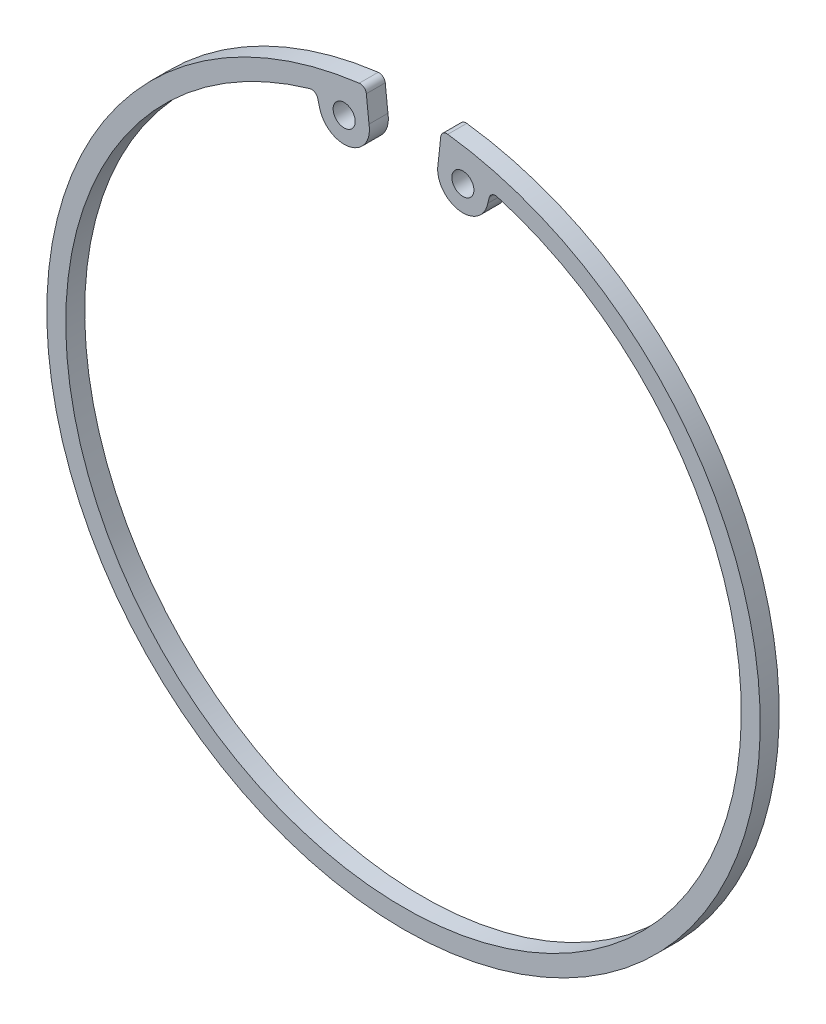
ISO-10303-21;
HEADER;
FILE_DESCRIPTION(('STEP AP214'),'2;1');
FILE_NAME('part.step','',(''),(''),'','','');
FILE_SCHEMA(('AUTOMOTIVE_DESIGN { 1 0 10303 214 1 1 1 1 }'));
ENDSEC;
DATA;
#1=APPLICATION_CONTEXT('core data for automotive mechanical design processes');
#2=APPLICATION_PROTOCOL_DEFINITION('international standard','automotive_design',2000,#1);
#3=PRODUCT_CONTEXT('',#1,'mechanical');
#4=PRODUCT('Part','Part','',(#3));
#5=PRODUCT_RELATED_PRODUCT_CATEGORY('part','',(#4));
#6=PRODUCT_DEFINITION_FORMATION('','',#4);
#7=PRODUCT_DEFINITION_CONTEXT('part definition',#1,'design');
#8=PRODUCT_DEFINITION('design','',#6,#7);
#9=PRODUCT_DEFINITION_SHAPE('','',#8);
#10=(LENGTH_UNIT() NAMED_UNIT(*) SI_UNIT(.MILLI.,.METRE.));
#11=(NAMED_UNIT(*) PLANE_ANGLE_UNIT() SI_UNIT($,.RADIAN.));
#12=(NAMED_UNIT(*) SI_UNIT($,.STERADIAN.) SOLID_ANGLE_UNIT());
#13=UNCERTAINTY_MEASURE_WITH_UNIT(LENGTH_MEASURE(1.E-05),#10,'distance_accuracy_value','');
#14=(GEOMETRIC_REPRESENTATION_CONTEXT(3) GLOBAL_UNCERTAINTY_ASSIGNED_CONTEXT((#13)) GLOBAL_UNIT_ASSIGNED_CONTEXT((#10,
#11,#12)) REPRESENTATION_CONTEXT('',''));
#15=CARTESIAN_POINT('',(0.,0.,0.));
#16=DIRECTION('',(0.,0.,1.));
#17=DIRECTION('',(1.,0.,0.));
#18=AXIS2_PLACEMENT_3D('',#15,#16,#17);
#19=CARTESIAN_POINT('',(-9.40140029789351,50.4763674647716,3.));
#20=DIRECTION('',(0.,0.,1.));
#21=DIRECTION('',(1.,0.,0.));
#22=AXIS2_PLACEMENT_3D('',#19,#20,#21);
#23=PLANE('',#22);
#24=CARTESIAN_POINT('',(-9.40140029789351,50.4763674647716,3.));
#25=DIRECTION('',(0.,0.,1.));
#26=DIRECTION('',(1.,0.,0.));
#27=AXIS2_PLACEMENT_3D('',#24,#25,#26);
#28=CIRCLE('',#27,1.74999999999995);
#29=CARTESIAN_POINT('',(-7.65140029789356,50.4763674647716,3.));
#30=VERTEX_POINT('',#29);
#31=EDGE_CURVE('E161',#30,#30,#28,.T.);
#32=ORIENTED_EDGE('',*,*,#31,.F.);
#33=EDGE_LOOP('',(#32));
#34=FACE_BOUND('',#33,.T.);
#35=CARTESIAN_POINT('',(-9.40140029789351,50.4763674647716,3.));
#36=DIRECTION('',(0.,0.,1.));
#37=DIRECTION('',(1.,0.,0.));
#38=AXIS2_PLACEMENT_3D('',#35,#36,#37);
#39=CIRCLE('',#38,3.99999999999983);
#40=CARTESIAN_POINT('',(-13.3337740471144,49.7439490758446,3.));
#41=VERTEX_POINT('',#40);
#42=CARTESIAN_POINT('',(-5.46902654867294,51.2087858536985,3.));
#43=VERTEX_POINT('',#42);
#44=EDGE_CURVE('E181',#41,#43,#39,.T.);
#45=ORIENTED_EDGE('',*,*,#44,.T.);
#46=DIRECTION('',(-0.106194690265146,0.994345356382525,0.));
#47=VECTOR('',#46,1.);
#48=CARTESIAN_POINT('',(-5.57420976918424,52.1936603951999,3.));
#49=LINE('',#48,#47);
#50=CARTESIAN_POINT('',(-5.89284852315195,55.1772084857796,3.));
#51=VERTEX_POINT('',#50);
#52=EDGE_CURVE('E108',#43,#51,#49,.T.);
#53=ORIENTED_EDGE('',*,*,#52,.T.);
#54=CARTESIAN_POINT('',(-6.88719387953451,55.0710137955141,3.));
#55=DIRECTION('',(0.,0.,1.));
#56=DIRECTION('',(1.,0.,0.));
#57=AXIS2_PLACEMENT_3D('',#54,#55,#56);
#58=CIRCLE('',#57,1.00000000000004);
#59=CARTESIAN_POINT('',(-7.01128746294948,56.0632843143522,3.));
#60=VERTEX_POINT('',#59);
#61=EDGE_CURVE('E208',#51,#60,#58,.T.);
#62=ORIENTED_EDGE('',*,*,#61,.T.);
#63=CARTESIAN_POINT('',(0.,0.,3.));
#64=DIRECTION('',(0.,0.,1.));
#65=DIRECTION('',(1.,0.,0.));
#66=AXIS2_PLACEMENT_3D('',#63,#64,#65);
#67=CIRCLE('',#66,56.5);
#68=CARTESIAN_POINT('',(7.01128746294949,56.0632843143522,3.));
#69=VERTEX_POINT('',#68);
#70=EDGE_CURVE('E226',#60,#69,#67,.T.);
#71=ORIENTED_EDGE('',*,*,#70,.T.);
#72=CARTESIAN_POINT('',(6.88719387953445,55.0710137955141,3.));
#73=DIRECTION('',(0.,0.,1.));
#74=DIRECTION('',(-1.,0.,0.));
#75=AXIS2_PLACEMENT_3D('',#72,#73,#74);
#76=CIRCLE('',#75,1.00000000000001);
#77=CARTESIAN_POINT('',(5.89284852315195,55.1772084857796,3.));
#78=VERTEX_POINT('',#77);
#79=EDGE_CURVE('E223',#69,#78,#76,.T.);
#80=ORIENTED_EDGE('',*,*,#79,.T.);
#81=DIRECTION('',(-0.106194690265486,-0.994345356382488,0.));
#82=VECTOR('',#81,1.);
#83=CARTESIAN_POINT('',(5.89284852315195,55.1772084857796,3.));
#84=LINE('',#83,#82);
#85=CARTESIAN_POINT('',(5.46902654867261,51.2087858536985,3.));
#86=VERTEX_POINT('',#85);
#87=EDGE_CURVE('E225',#78,#86,#84,.T.);
#88=ORIENTED_EDGE('',*,*,#87,.T.);
#89=CARTESIAN_POINT('',(9.40140029789353,50.4763674647716,3.));
#90=DIRECTION('',(0.,0.,1.));
#91=DIRECTION('',(1.,0.,0.));
#92=AXIS2_PLACEMENT_3D('',#89,#90,#91);
#93=CIRCLE('',#92,4.);
#94=CARTESIAN_POINT('',(13.3337740471144,49.7439490758446,3.));
#95=VERTEX_POINT('',#94);
#96=EDGE_CURVE('E228',#86,#95,#93,.T.);
#97=ORIENTED_EDGE('',*,*,#96,.T.);
#98=DIRECTION('',(0.258908233924605,0.965901923802848,0.));
#99=VECTOR('',#98,1.);
#100=CARTESIAN_POINT('',(13.5902162646404,50.7006510991753,3.));
#101=LINE('',#100,#99);
#102=CARTESIAN_POINT('',(13.5902162646404,50.7006510991753,3.));
#103=VERTEX_POINT('',#102);
#104=EDGE_CURVE('E234',#95,#103,#101,.T.);
#105=ORIENTED_EDGE('',*,*,#104,.T.);
#106=CARTESIAN_POINT('',(14.5561181884432,50.4417428652507,3.));
#107=DIRECTION('',(0.,0.,-1.));
#108=DIRECTION('',(-1.,0.,0.));
#109=AXIS2_PLACEMENT_3D('',#106,#107,#108);
#110=CIRCLE('',#109,0.999999999999958);
#111=CARTESIAN_POINT('',(14.8333775825089,51.4025379674459,3.));
#112=VERTEX_POINT('',#111);
#113=EDGE_CURVE('E139',#103,#112,#110,.T.);
#114=ORIENTED_EDGE('',*,*,#113,.T.);
#115=CARTESIAN_POINT('',(0.,0.,3.));
#116=DIRECTION('',(0.,0.,-1.));
#117=DIRECTION('',(1.,0.,0.));
#118=AXIS2_PLACEMENT_3D('',#115,#116,#117);
#119=CIRCLE('',#118,53.5);
#120=CARTESIAN_POINT('',(-14.8333775825088,51.402537967446,3.));
#121=VERTEX_POINT('',#120);
#122=EDGE_CURVE('E133',#112,#121,#119,.T.);
#123=ORIENTED_EDGE('',*,*,#122,.T.);
#124=CARTESIAN_POINT('',(-14.5561181884432,50.4417428652507,3.));
#125=DIRECTION('',(0.,0.,-1.));
#126=DIRECTION('',(1.,0.,0.));
#127=AXIS2_PLACEMENT_3D('',#124,#125,#126);
#128=CIRCLE('',#127,1.);
#129=CARTESIAN_POINT('',(-13.5902162646404,50.7006510991753,3.));
#130=VERTEX_POINT('',#129);
#131=EDGE_CURVE('E137',#121,#130,#128,.T.);
#132=ORIENTED_EDGE('',*,*,#131,.T.);
#133=DIRECTION('',(0.258908233924564,-0.965901923802858,0.));
#134=VECTOR('',#133,1.);
#135=CARTESIAN_POINT('',(-13.5902162646404,50.7006510991753,3.));
#136=LINE('',#135,#134);
#137=EDGE_CURVE('E53',#130,#41,#136,.T.);
#138=ORIENTED_EDGE('',*,*,#137,.T.);
#139=EDGE_LOOP('',(#45,#53,#62,#71,#80,#88,#97,#105,#114,#123,#132,#138));
#140=FACE_BOUND('',#139,.T.);
#141=CARTESIAN_POINT('',(9.40140029789353,50.4763674647716,3.));
#142=DIRECTION('',(0.,0.,1.));
#143=DIRECTION('',(1.,0.,0.));
#144=AXIS2_PLACEMENT_3D('',#141,#142,#143);
#145=CIRCLE('',#144,1.75000000000069);
#146=CARTESIAN_POINT('',(11.1514002978942,50.4763674647716,3.));
#147=VERTEX_POINT('',#146);
#148=EDGE_CURVE('E276',#147,#147,#145,.T.);
#149=ORIENTED_EDGE('',*,*,#148,.F.);
#150=EDGE_LOOP('',(#149));
#151=FACE_BOUND('',#150,.T.);
#152=ADVANCED_FACE('F36',(#34,#140,#151),#23,.T.);
#153=CARTESIAN_POINT('',(-9.40140029789351,50.4763674647716,0.));
#154=DIRECTION('',(0.,0.,1.));
#155=DIRECTION('',(1.,0.,0.));
#156=AXIS2_PLACEMENT_3D('',#153,#154,#155);
#157=PLANE('',#156);
#158=CARTESIAN_POINT('',(-9.40140029789351,50.4763674647716,0.));
#159=DIRECTION('',(0.,0.,1.));
#160=DIRECTION('',(1.,0.,0.));
#161=AXIS2_PLACEMENT_3D('',#158,#159,#160);
#162=CIRCLE('',#161,3.99999999999983);
#163=CARTESIAN_POINT('',(-13.3337740471144,49.7439490758446,0.));
#164=VERTEX_POINT('',#163);
#165=CARTESIAN_POINT('',(-5.46902654867294,51.2087858536985,0.));
#166=VERTEX_POINT('',#165);
#167=EDGE_CURVE('E157',#164,#166,#162,.T.);
#168=ORIENTED_EDGE('',*,*,#167,.F.);
#169=DIRECTION('',(0.258908233924564,-0.965901923802858,0.));
#170=VECTOR('',#169,1.);
#171=CARTESIAN_POINT('',(-13.5902162646404,50.7006510991753,0.));
#172=LINE('',#171,#170);
#173=CARTESIAN_POINT('',(-13.5902162646404,50.7006510991753,0.));
#174=VERTEX_POINT('',#173);
#175=EDGE_CURVE('E100',#174,#164,#172,.T.);
#176=ORIENTED_EDGE('',*,*,#175,.F.);
#177=CARTESIAN_POINT('',(-14.5561181884432,50.4417428652507,0.));
#178=DIRECTION('',(0.,0.,-1.));
#179=DIRECTION('',(1.,0.,0.));
#180=AXIS2_PLACEMENT_3D('',#177,#178,#179);
#181=CIRCLE('',#180,1.);
#182=CARTESIAN_POINT('',(-14.8333775825088,51.402537967446,0.));
#183=VERTEX_POINT('',#182);
#184=EDGE_CURVE('E94',#183,#174,#181,.T.);
#185=ORIENTED_EDGE('',*,*,#184,.F.);
#186=CARTESIAN_POINT('',(0.,0.,0.));
#187=DIRECTION('',(0.,0.,-1.));
#188=DIRECTION('',(1.,0.,0.));
#189=AXIS2_PLACEMENT_3D('',#186,#187,#188);
#190=CIRCLE('',#189,53.5);
#191=CARTESIAN_POINT('',(14.8333775825089,51.4025379674459,0.));
#192=VERTEX_POINT('',#191);
#193=EDGE_CURVE('E147',#192,#183,#190,.T.);
#194=ORIENTED_EDGE('',*,*,#193,.F.);
#195=CARTESIAN_POINT('',(14.5561181884432,50.4417428652507,0.));
#196=DIRECTION('',(0.,0.,-1.));
#197=DIRECTION('',(-1.,0.,0.));
#198=AXIS2_PLACEMENT_3D('',#195,#196,#197);
#199=CIRCLE('',#198,0.999999999999958);
#200=CARTESIAN_POINT('',(13.5902162646404,50.7006510991753,0.));
#201=VERTEX_POINT('',#200);
#202=EDGE_CURVE('E176',#201,#192,#199,.T.);
#203=ORIENTED_EDGE('',*,*,#202,.F.);
#204=DIRECTION('',(0.258908233924605,0.965901923802848,0.));
#205=VECTOR('',#204,1.);
#206=CARTESIAN_POINT('',(13.5902162646404,50.7006510991753,0.));
#207=LINE('',#206,#205);
#208=CARTESIAN_POINT('',(13.3337740471144,49.7439490758446,0.));
#209=VERTEX_POINT('',#208);
#210=EDGE_CURVE('E174',#209,#201,#207,.T.);
#211=ORIENTED_EDGE('',*,*,#210,.F.);
#212=CARTESIAN_POINT('',(9.40140029789353,50.4763674647716,0.));
#213=DIRECTION('',(0.,0.,1.));
#214=DIRECTION('',(1.,0.,0.));
#215=AXIS2_PLACEMENT_3D('',#212,#213,#214);
#216=CIRCLE('',#215,4.);
#217=CARTESIAN_POINT('',(5.46902654867261,51.2087858536985,0.));
#218=VERTEX_POINT('',#217);
#219=EDGE_CURVE('E172',#218,#209,#216,.T.);
#220=ORIENTED_EDGE('',*,*,#219,.F.);
#221=DIRECTION('',(-0.106194690265479,-0.994345356382489,0.));
#222=VECTOR('',#221,1.);
#223=CARTESIAN_POINT('',(5.57420976918425,52.1936603951999,0.));
#224=LINE('',#223,#222);
#225=CARTESIAN_POINT('',(5.89284852315195,55.1772084857796,0.));
#226=VERTEX_POINT('',#225);
#227=EDGE_CURVE('E170',#226,#218,#224,.T.);
#228=ORIENTED_EDGE('',*,*,#227,.F.);
#229=CARTESIAN_POINT('',(6.88719387953445,55.0710137955141,0.));
#230=DIRECTION('',(0.,0.,1.));
#231=DIRECTION('',(-1.,0.,0.));
#232=AXIS2_PLACEMENT_3D('',#229,#230,#231);
#233=CIRCLE('',#232,1.00000000000001);
#234=CARTESIAN_POINT('',(7.01128746294949,56.0632843143522,0.));
#235=VERTEX_POINT('',#234);
#236=EDGE_CURVE('E167',#235,#226,#233,.T.);
#237=ORIENTED_EDGE('',*,*,#236,.F.);
#238=CARTESIAN_POINT('',(0.,0.,0.));
#239=DIRECTION('',(0.,0.,1.));
#240=DIRECTION('',(1.,0.,0.));
#241=AXIS2_PLACEMENT_3D('',#238,#239,#240);
#242=CIRCLE('',#241,56.5);
#243=CARTESIAN_POINT('',(-7.01128746294948,56.0632843143522,0.));
#244=VERTEX_POINT('',#243);
#245=EDGE_CURVE('E165',#244,#235,#242,.T.);
#246=ORIENTED_EDGE('',*,*,#245,.F.);
#247=CARTESIAN_POINT('',(-6.88719387953451,55.0710137955141,0.));
#248=DIRECTION('',(0.,0.,1.));
#249=DIRECTION('',(1.,0.,0.));
#250=AXIS2_PLACEMENT_3D('',#247,#248,#249);
#251=CIRCLE('',#250,1.00000000000004);
#252=CARTESIAN_POINT('',(-5.89284852315195,55.1772084857796,0.));
#253=VERTEX_POINT('',#252);
#254=EDGE_CURVE('E163',#253,#244,#251,.T.);
#255=ORIENTED_EDGE('',*,*,#254,.F.);
#256=DIRECTION('',(-0.106194690265488,0.994345356382488,0.));
#257=VECTOR('',#256,1.);
#258=CARTESIAN_POINT('',(-5.89284852315195,55.1772084857796,0.));
#259=LINE('',#258,#257);
#260=EDGE_CURVE('E160',#166,#253,#259,.T.);
#261=ORIENTED_EDGE('',*,*,#260,.F.);
#262=EDGE_LOOP('',(#168,#176,#185,#194,#203,#211,#220,#228,#237,#246,#255,#261));
#263=FACE_BOUND('',#262,.T.);
#264=CARTESIAN_POINT('',(-9.40140029789351,50.4763674647716,0.));
#265=DIRECTION('',(0.,0.,1.));
#266=DIRECTION('',(1.,0.,0.));
#267=AXIS2_PLACEMENT_3D('',#264,#265,#266);
#268=CIRCLE('',#267,1.74999999999995);
#269=CARTESIAN_POINT('',(-7.65140029789356,50.4763674647716,0.));
#270=VERTEX_POINT('',#269);
#271=EDGE_CURVE('E282',#270,#270,#268,.T.);
#272=ORIENTED_EDGE('',*,*,#271,.T.);
#273=EDGE_LOOP('',(#272));
#274=FACE_BOUND('',#273,.T.);
#275=CARTESIAN_POINT('',(9.40140029789353,50.4763674647716,0.));
#276=DIRECTION('',(0.,0.,1.));
#277=DIRECTION('',(1.,0.,0.));
#278=AXIS2_PLACEMENT_3D('',#275,#276,#277);
#279=CIRCLE('',#278,1.75000000000069);
#280=CARTESIAN_POINT('',(11.1514002978942,50.4763674647716,0.));
#281=VERTEX_POINT('',#280);
#282=EDGE_CURVE('E279',#281,#281,#279,.T.);
#283=ORIENTED_EDGE('',*,*,#282,.T.);
#284=EDGE_LOOP('',(#283));
#285=FACE_BOUND('',#284,.T.);
#286=ADVANCED_FACE('F212',(#263,#274,#285),#157,.F.);
#287=CARTESIAN_POINT('',(-9.40140029789351,50.4763674647716,3.));
#288=DIRECTION('',(0.,0.,-1.));
#289=DIRECTION('',(-1.,0.,0.));
#290=AXIS2_PLACEMENT_3D('',#287,#288,#289);
#291=CYLINDRICAL_SURFACE('',#290,3.99999999999983);
#292=ORIENTED_EDGE('',*,*,#167,.T.);
#293=DIRECTION('',(0.,0.,-1.));
#294=VECTOR('',#293,1.);
#295=CARTESIAN_POINT('',(-5.46902654867294,51.2087858536985,3.));
#296=LINE('',#295,#294);
#297=EDGE_CURVE('E11',#43,#166,#296,.T.);
#298=ORIENTED_EDGE('',*,*,#297,.F.);
#299=ORIENTED_EDGE('',*,*,#44,.F.);
#300=DIRECTION('',(0.,0.,-1.));
#301=VECTOR('',#300,1.);
#302=CARTESIAN_POINT('',(-13.3337740471144,49.7439490758446,3.));
#303=LINE('',#302,#301);
#304=EDGE_CURVE('E153',#41,#164,#303,.T.);
#305=ORIENTED_EDGE('',*,*,#304,.T.);
#306=EDGE_LOOP('',(#292,#298,#299,#305));
#307=FACE_BOUND('',#306,.T.);
#308=ADVANCED_FACE('F38',(#307),#291,.T.);
#309=CARTESIAN_POINT('',(-5.89284852315195,55.1772084857796,3.));
#310=DIRECTION('',(-0.994345356382488,-0.106194690265488,0.));
#311=DIRECTION('',(0.106194690265489,-0.994345356382488,0.));
#312=AXIS2_PLACEMENT_3D('',#309,#310,#311);
#313=PLANE('',#312);
#314=ORIENTED_EDGE('',*,*,#260,.T.);
#315=DIRECTION('',(0.,0.,-1.));
#316=VECTOR('',#315,1.);
#317=CARTESIAN_POINT('',(-5.89284852315195,55.1772084857796,3.));
#318=LINE('',#317,#316);
#319=EDGE_CURVE('E45',#51,#253,#318,.T.);
#320=ORIENTED_EDGE('',*,*,#319,.F.);
#321=ORIENTED_EDGE('',*,*,#52,.F.);
#322=ORIENTED_EDGE('',*,*,#297,.T.);
#323=EDGE_LOOP('',(#314,#320,#321,#322));
#324=FACE_BOUND('',#323,.T.);
#325=ADVANCED_FACE('F376',(#324),#313,.F.);
#326=CARTESIAN_POINT('',(-6.88719387953451,55.0710137955141,3.));
#327=DIRECTION('',(0.,0.,-1.));
#328=DIRECTION('',(-1.,0.,0.));
#329=AXIS2_PLACEMENT_3D('',#326,#327,#328);
#330=CYLINDRICAL_SURFACE('',#329,1.00000000000004);
#331=ORIENTED_EDGE('',*,*,#254,.T.);
#332=DIRECTION('',(0.,0.,-1.));
#333=VECTOR('',#332,1.);
#334=CARTESIAN_POINT('',(-7.01128746294948,56.0632843143522,3.));
#335=LINE('',#334,#333);
#336=EDGE_CURVE('E200',#60,#244,#335,.T.);
#337=ORIENTED_EDGE('',*,*,#336,.F.);
#338=ORIENTED_EDGE('',*,*,#61,.F.);
#339=ORIENTED_EDGE('',*,*,#319,.T.);
#340=EDGE_LOOP('',(#331,#337,#338,#339));
#341=FACE_BOUND('',#340,.T.);
#342=ADVANCED_FACE('F206',(#341),#330,.T.);
#343=CARTESIAN_POINT('',(0.,0.,3.));
#344=DIRECTION('',(0.,0.,-1.));
#345=DIRECTION('',(-1.,0.,0.));
#346=AXIS2_PLACEMENT_3D('',#343,#344,#345);
#347=CYLINDRICAL_SURFACE('',#346,56.5);
#348=ORIENTED_EDGE('',*,*,#245,.T.);
#349=DIRECTION('',(0.,0.,-1.));
#350=VECTOR('',#349,1.);
#351=CARTESIAN_POINT('',(7.01128746294949,56.0632843143522,3.));
#352=LINE('',#351,#350);
#353=EDGE_CURVE('E197',#69,#235,#352,.T.);
#354=ORIENTED_EDGE('',*,*,#353,.F.);
#355=ORIENTED_EDGE('',*,*,#70,.F.);
#356=ORIENTED_EDGE('',*,*,#336,.T.);
#357=EDGE_LOOP('',(#348,#354,#355,#356));
#358=FACE_BOUND('',#357,.T.);
#359=ADVANCED_FACE('F217',(#358),#347,.T.);
#360=CARTESIAN_POINT('',(6.88719387953445,55.0710137955141,3.));
#361=DIRECTION('',(0.,0.,-1.));
#362=DIRECTION('',(-1.,0.,0.));
#363=AXIS2_PLACEMENT_3D('',#360,#361,#362);
#364=CYLINDRICAL_SURFACE('',#363,1.00000000000001);
#365=ORIENTED_EDGE('',*,*,#236,.T.);
#366=DIRECTION('',(0.,0.,-1.));
#367=VECTOR('',#366,1.);
#368=CARTESIAN_POINT('',(5.89284852315195,55.1772084857796,3.));
#369=LINE('',#368,#367);
#370=EDGE_CURVE('E194',#78,#226,#369,.T.);
#371=ORIENTED_EDGE('',*,*,#370,.F.);
#372=ORIENTED_EDGE('',*,*,#79,.F.);
#373=ORIENTED_EDGE('',*,*,#353,.T.);
#374=EDGE_LOOP('',(#365,#371,#372,#373));
#375=FACE_BOUND('',#374,.T.);
#376=ADVANCED_FACE('F221',(#375),#364,.T.);
#377=CARTESIAN_POINT('',(5.57420976918425,52.1936603951999,3.));
#378=DIRECTION('',(0.994345356382489,-0.106194690265479,0.));
#379=DIRECTION('',(0.106194690265479,0.994345356382489,0.));
#380=AXIS2_PLACEMENT_3D('',#377,#378,#379);
#381=PLANE('',#380);
#382=ORIENTED_EDGE('',*,*,#227,.T.);
#383=DIRECTION('',(0.,0.,-1.));
#384=VECTOR('',#383,1.);
#385=CARTESIAN_POINT('',(5.46902654867261,51.2087858536985,3.));
#386=LINE('',#385,#384);
#387=EDGE_CURVE('E191',#86,#218,#386,.T.);
#388=ORIENTED_EDGE('',*,*,#387,.F.);
#389=ORIENTED_EDGE('',*,*,#87,.F.);
#390=ORIENTED_EDGE('',*,*,#370,.T.);
#391=EDGE_LOOP('',(#382,#388,#389,#390));
#392=FACE_BOUND('',#391,.T.);
#393=ADVANCED_FACE('F340',(#392),#381,.F.);
#394=CARTESIAN_POINT('',(9.40140029789353,50.4763674647716,3.));
#395=DIRECTION('',(0.,0.,-1.));
#396=DIRECTION('',(-1.,0.,0.));
#397=AXIS2_PLACEMENT_3D('',#394,#395,#396);
#398=CYLINDRICAL_SURFACE('',#397,4.);
#399=ORIENTED_EDGE('',*,*,#219,.T.);
#400=DIRECTION('',(0.,0.,-1.));
#401=VECTOR('',#400,1.);
#402=CARTESIAN_POINT('',(13.3337740471144,49.7439490758446,3.));
#403=LINE('',#402,#401);
#404=EDGE_CURVE('E188',#95,#209,#403,.T.);
#405=ORIENTED_EDGE('',*,*,#404,.F.);
#406=ORIENTED_EDGE('',*,*,#96,.F.);
#407=ORIENTED_EDGE('',*,*,#387,.T.);
#408=EDGE_LOOP('',(#399,#405,#406,#407));
#409=FACE_BOUND('',#408,.T.);
#410=ADVANCED_FACE('F331',(#409),#398,.T.);
#411=CARTESIAN_POINT('',(13.5902162646404,50.7006510991753,3.));
#412=DIRECTION('',(-0.965901923802848,0.258908233924605,0.));
#413=DIRECTION('',(-0.258908233924605,-0.965901923802848,0.));
#414=AXIS2_PLACEMENT_3D('',#411,#412,#413);
#415=PLANE('',#414);
#416=ORIENTED_EDGE('',*,*,#210,.T.);
#417=DIRECTION('',(0.,0.,-1.));
#418=VECTOR('',#417,1.);
#419=CARTESIAN_POINT('',(13.5902162646404,50.7006510991753,3.));
#420=LINE('',#419,#418);
#421=EDGE_CURVE('E185',#103,#201,#420,.T.);
#422=ORIENTED_EDGE('',*,*,#421,.F.);
#423=ORIENTED_EDGE('',*,*,#104,.F.);
#424=ORIENTED_EDGE('',*,*,#404,.T.);
#425=EDGE_LOOP('',(#416,#422,#423,#424));
#426=FACE_BOUND('',#425,.T.);
#427=ADVANCED_FACE('F240',(#426),#415,.F.);
#428=CARTESIAN_POINT('',(14.5561181884432,50.4417428652507,3.));
#429=DIRECTION('',(0.,0.,-1.));
#430=DIRECTION('',(-1.,0.,0.));
#431=AXIS2_PLACEMENT_3D('',#428,#429,#430);
#432=CYLINDRICAL_SURFACE('',#431,0.999999999999958);
#433=ORIENTED_EDGE('',*,*,#202,.T.);
#434=DIRECTION('',(0.,0.,-1.));
#435=VECTOR('',#434,1.);
#436=CARTESIAN_POINT('',(14.8333775825089,51.4025379674459,3.));
#437=LINE('',#436,#435);
#438=EDGE_CURVE('E148',#112,#192,#437,.T.);
#439=ORIENTED_EDGE('',*,*,#438,.F.);
#440=ORIENTED_EDGE('',*,*,#113,.F.);
#441=ORIENTED_EDGE('',*,*,#421,.T.);
#442=EDGE_LOOP('',(#433,#439,#440,#441));
#443=FACE_BOUND('',#442,.T.);
#444=ADVANCED_FACE('F244',(#443),#432,.F.);
#445=CARTESIAN_POINT('',(0.,0.,3.));
#446=DIRECTION('',(0.,0.,-1.));
#447=DIRECTION('',(-1.,0.,0.));
#448=AXIS2_PLACEMENT_3D('',#445,#446,#447);
#449=CYLINDRICAL_SURFACE('',#448,53.5);
#450=ORIENTED_EDGE('',*,*,#193,.T.);
#451=DIRECTION('',(0.,0.,-1.));
#452=VECTOR('',#451,1.);
#453=CARTESIAN_POINT('',(-14.8333775825088,51.402537967446,3.));
#454=LINE('',#453,#452);
#455=EDGE_CURVE('E144',#121,#183,#454,.T.);
#456=ORIENTED_EDGE('',*,*,#455,.F.);
#457=ORIENTED_EDGE('',*,*,#122,.F.);
#458=ORIENTED_EDGE('',*,*,#438,.T.);
#459=EDGE_LOOP('',(#450,#456,#457,#458));
#460=FACE_BOUND('',#459,.T.);
#461=ADVANCED_FACE('F145',(#460),#449,.F.);
#462=CARTESIAN_POINT('',(-14.5561181884432,50.4417428652507,3.));
#463=DIRECTION('',(0.,0.,-1.));
#464=DIRECTION('',(-1.,0.,0.));
#465=AXIS2_PLACEMENT_3D('',#462,#463,#464);
#466=CYLINDRICAL_SURFACE('',#465,1.);
#467=ORIENTED_EDGE('',*,*,#184,.T.);
#468=DIRECTION('',(0.,0.,-1.));
#469=VECTOR('',#468,1.);
#470=CARTESIAN_POINT('',(-13.5902162646404,50.7006510991753,3.));
#471=LINE('',#470,#469);
#472=EDGE_CURVE('E149',#130,#174,#471,.T.);
#473=ORIENTED_EDGE('',*,*,#472,.F.);
#474=ORIENTED_EDGE('',*,*,#131,.F.);
#475=ORIENTED_EDGE('',*,*,#455,.T.);
#476=EDGE_LOOP('',(#467,#473,#474,#475));
#477=FACE_BOUND('',#476,.T.);
#478=ADVANCED_FACE('F151',(#477),#466,.F.);
#479=CARTESIAN_POINT('',(-13.5902162646404,50.7006510991753,3.));
#480=DIRECTION('',(0.965901923802859,0.258908233924564,0.));
#481=DIRECTION('',(-0.258908233924564,0.965901923802859,0.));
#482=AXIS2_PLACEMENT_3D('',#479,#480,#481);
#483=PLANE('',#482);
#484=ORIENTED_EDGE('',*,*,#175,.T.);
#485=ORIENTED_EDGE('',*,*,#304,.F.);
#486=ORIENTED_EDGE('',*,*,#137,.F.);
#487=ORIENTED_EDGE('',*,*,#472,.T.);
#488=EDGE_LOOP('',(#484,#485,#486,#487));
#489=FACE_BOUND('',#488,.T.);
#490=ADVANCED_FACE('F248',(#489),#483,.F.);
#491=CARTESIAN_POINT('',(-9.40140029789351,50.4763674647716,3.));
#492=DIRECTION('',(0.,0.,-1.));
#493=DIRECTION('',(-1.,0.,0.));
#494=AXIS2_PLACEMENT_3D('',#491,#492,#493);
#495=CYLINDRICAL_SURFACE('',#494,1.74999999999995);
#496=ORIENTED_EDGE('',*,*,#31,.T.);
#497=EDGE_LOOP('',(#496));
#498=FACE_BOUND('',#497,.T.);
#499=ORIENTED_EDGE('',*,*,#271,.F.);
#500=EDGE_LOOP('',(#499));
#501=FACE_BOUND('',#500,.T.);
#502=ADVANCED_FACE('F250',(#498,#501),#495,.F.);
#503=CARTESIAN_POINT('',(9.40140029789353,50.4763674647716,3.));
#504=DIRECTION('',(0.,0.,-1.));
#505=DIRECTION('',(-1.,0.,0.));
#506=AXIS2_PLACEMENT_3D('',#503,#504,#505);
#507=CYLINDRICAL_SURFACE('',#506,1.75000000000069);
#508=ORIENTED_EDGE('',*,*,#148,.T.);
#509=EDGE_LOOP('',(#508));
#510=FACE_BOUND('',#509,.T.);
#511=ORIENTED_EDGE('',*,*,#282,.F.);
#512=EDGE_LOOP('',(#511));
#513=FACE_BOUND('',#512,.T.);
#514=ADVANCED_FACE('F256',(#510,#513),#507,.F.);
#515=CLOSED_SHELL('',(#152,#286,#308,#325,#342,#359,#376,#393,#410,#427,#444,#461,#478,#490,
#502,#514));
#516=MANIFOLD_SOLID_BREP('B2',#515);
#517=ADVANCED_BREP_SHAPE_REPRESENTATION('',(#18,#516),#14);
#518=SHAPE_DEFINITION_REPRESENTATION(#9,#517);
ENDSEC;
END-ISO-10303-21;
